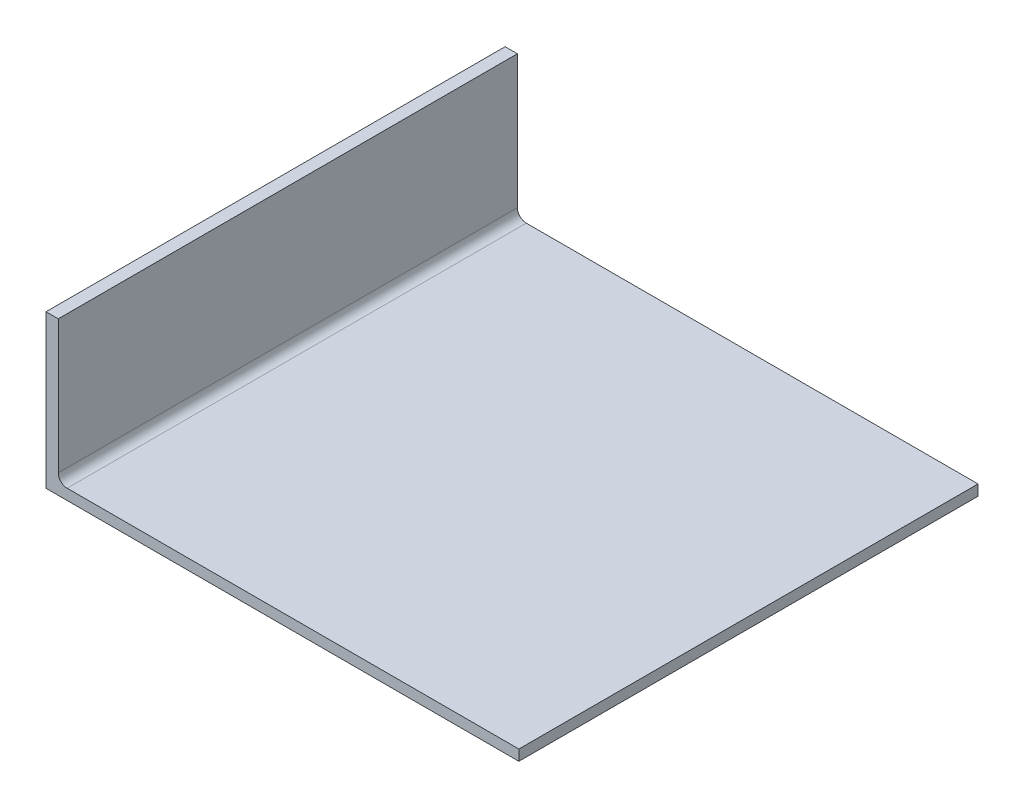
ISO-10303-21;
HEADER;
FILE_DESCRIPTION(('STEP AP214'),'2;1');
FILE_NAME('part.step','',(''),(''),'','','');
FILE_SCHEMA(('AUTOMOTIVE_DESIGN { 1 0 10303 214 1 1 1 1 }'));
ENDSEC;
DATA;
#1=APPLICATION_CONTEXT('core data for automotive mechanical design processes');
#2=APPLICATION_PROTOCOL_DEFINITION('international standard','automotive_design',2000,#1);
#3=PRODUCT_CONTEXT('',#1,'mechanical');
#4=PRODUCT('Part','Part','',(#3));
#5=PRODUCT_RELATED_PRODUCT_CATEGORY('part','',(#4));
#6=PRODUCT_DEFINITION_FORMATION('','',#4);
#7=PRODUCT_DEFINITION_CONTEXT('part definition',#1,'design');
#8=PRODUCT_DEFINITION('design','',#6,#7);
#9=PRODUCT_DEFINITION_SHAPE('','',#8);
#10=(LENGTH_UNIT() NAMED_UNIT(*) SI_UNIT(.MILLI.,.METRE.));
#11=(NAMED_UNIT(*) PLANE_ANGLE_UNIT() SI_UNIT($,.RADIAN.));
#12=(NAMED_UNIT(*) SI_UNIT($,.STERADIAN.) SOLID_ANGLE_UNIT());
#13=UNCERTAINTY_MEASURE_WITH_UNIT(LENGTH_MEASURE(1.E-05),#10,'distance_accuracy_value','');
#14=(GEOMETRIC_REPRESENTATION_CONTEXT(3) GLOBAL_UNCERTAINTY_ASSIGNED_CONTEXT((#13)) GLOBAL_UNIT_ASSIGNED_CONTEXT((#10,
#11,#12)) REPRESENTATION_CONTEXT('',''));
#15=CARTESIAN_POINT('',(0.,0.,0.));
#16=DIRECTION('',(0.,0.,1.));
#17=DIRECTION('',(1.,0.,0.));
#18=AXIS2_PLACEMENT_3D('',#15,#16,#17);
#19=CARTESIAN_POINT('',(-250.24028816854,11.,-21.2242669249853));
#20=DIRECTION('',(0.,0.,1.));
#21=DIRECTION('',(1.,0.,0.));
#22=AXIS2_PLACEMENT_3D('',#19,#20,#21);
#23=CYLINDRICAL_SURFACE('',#22,5.);
#24=DIRECTION('',(0.,0.,-1.));
#25=VECTOR('',#24,1.);
#26=CARTESIAN_POINT('',(-255.24028816854,11.,-21.2242669249853));
#27=LINE('',#26,#25);
#28=CARTESIAN_POINT('',(-255.24028816854,11.,236.996907771633));
#29=VERTEX_POINT('',#28);
#30=CARTESIAN_POINT('',(-255.24028816854,11.,-21.2242669249853));
#31=VERTEX_POINT('',#30);
#32=EDGE_CURVE('E143',#29,#31,#27,.T.);
#33=ORIENTED_EDGE('',*,*,#32,.F.);
#34=CARTESIAN_POINT('',(-250.24028816854,11.,236.996907771633));
#35=DIRECTION('',(0.,0.,-1.));
#36=DIRECTION('',(-1.,0.,0.));
#37=AXIS2_PLACEMENT_3D('',#34,#35,#36);
#38=CIRCLE('',#37,5.);
#39=CARTESIAN_POINT('',(-250.24028816854,6.,236.996907771633));
#40=VERTEX_POINT('',#39);
#41=EDGE_CURVE('E40',#29,#40,#38,.F.);
#42=ORIENTED_EDGE('',*,*,#41,.T.);
#43=DIRECTION('',(0.,0.,-1.));
#44=VECTOR('',#43,1.);
#45=CARTESIAN_POINT('',(-250.24028816854,6.,-21.2242669249853));
#46=LINE('',#45,#44);
#47=CARTESIAN_POINT('',(-250.24028816854,6.,-21.2242669249853));
#48=VERTEX_POINT('',#47);
#49=EDGE_CURVE('E146',#48,#40,#46,.F.);
#50=ORIENTED_EDGE('',*,*,#49,.F.);
#51=CARTESIAN_POINT('',(-250.24028816854,11.,-21.2242669249853));
#52=DIRECTION('',(0.,0.,1.));
#53=DIRECTION('',(1.,0.,0.));
#54=AXIS2_PLACEMENT_3D('',#51,#52,#53);
#55=CIRCLE('',#54,5.);
#56=EDGE_CURVE('E11',#48,#31,#55,.F.);
#57=ORIENTED_EDGE('',*,*,#56,.T.);
#58=EDGE_LOOP('',(#33,#42,#50,#57));
#59=FACE_BOUND('',#58,.T.);
#60=ADVANCED_FACE('F33',(#59),#23,.F.);
#61=CARTESIAN_POINT('',(0.,6.,0.));
#62=DIRECTION('',(0.,-1.,0.));
#63=DIRECTION('',(0.,0.,-1.));
#64=AXIS2_PLACEMENT_3D('',#61,#62,#63);
#65=PLANE('',#64);
#66=DIRECTION('',(-1.,0.,0.));
#67=VECTOR('',#66,1.);
#68=CARTESIAN_POINT('',(3.81792051641128,6.,-21.2242669249854));
#69=LINE('',#68,#67);
#70=CARTESIAN_POINT('',(3.81792051641128,6.,-21.2242669249854));
#71=VERTEX_POINT('',#70);
#72=EDGE_CURVE('E125',#71,#48,#69,.T.);
#73=ORIENTED_EDGE('',*,*,#72,.T.);
#74=ORIENTED_EDGE('',*,*,#49,.T.);
#75=DIRECTION('',(1.,0.,0.));
#76=VECTOR('',#75,1.);
#77=CARTESIAN_POINT('',(3.81792051641131,6.,236.996907771633));
#78=LINE('',#77,#76);
#79=CARTESIAN_POINT('',(3.81792051641131,6.,236.996907771633));
#80=VERTEX_POINT('',#79);
#81=EDGE_CURVE('E129',#40,#80,#78,.T.);
#82=ORIENTED_EDGE('',*,*,#81,.T.);
#83=DIRECTION('',(0.,0.,-1.));
#84=VECTOR('',#83,1.);
#85=CARTESIAN_POINT('',(3.81792051641128,6.,-21.2242669249854));
#86=LINE('',#85,#84);
#87=EDGE_CURVE('E122',#80,#71,#86,.T.);
#88=ORIENTED_EDGE('',*,*,#87,.T.);
#89=EDGE_LOOP('',(#73,#74,#82,#88));
#90=FACE_BOUND('',#89,.T.);
#91=ADVANCED_FACE('F149',(#90),#65,.F.);
#92=CARTESIAN_POINT('',(3.81792051641128,6.,-21.2242669249854));
#93=DIRECTION('',(-1.,0.,0.));
#94=DIRECTION('',(0.,0.,1.));
#95=AXIS2_PLACEMENT_3D('',#92,#93,#94);
#96=PLANE('',#95);
#97=DIRECTION('',(0.,0.,-1.));
#98=VECTOR('',#97,1.);
#99=CARTESIAN_POINT('',(3.81792051641128,0.,-21.2242669249854));
#100=LINE('',#99,#98);
#101=CARTESIAN_POINT('',(3.81792051641131,0.,236.996907771633));
#102=VERTEX_POINT('',#101);
#103=CARTESIAN_POINT('',(3.81792051641128,0.,-21.2242669249854));
#104=VERTEX_POINT('',#103);
#105=EDGE_CURVE('E121',#102,#104,#100,.T.);
#106=ORIENTED_EDGE('',*,*,#105,.T.);
#107=DIRECTION('',(0.,-1.,0.));
#108=VECTOR('',#107,1.);
#109=CARTESIAN_POINT('',(3.81792051641128,6.,-21.2242669249854));
#110=LINE('',#109,#108);
#111=EDGE_CURVE('E140',#71,#104,#110,.T.);
#112=ORIENTED_EDGE('',*,*,#111,.F.);
#113=ORIENTED_EDGE('',*,*,#87,.F.);
#114=DIRECTION('',(0.,-1.,0.));
#115=VECTOR('',#114,1.);
#116=CARTESIAN_POINT('',(3.81792051641131,6.,236.996907771633));
#117=LINE('',#116,#115);
#118=EDGE_CURVE('E99',#80,#102,#117,.T.);
#119=ORIENTED_EDGE('',*,*,#118,.T.);
#120=EDGE_LOOP('',(#106,#112,#113,#119));
#121=FACE_BOUND('',#120,.T.);
#122=ADVANCED_FACE('F155',(#121),#96,.F.);
#123=CARTESIAN_POINT('',(3.81792051641128,6.,-21.2242669249854));
#124=DIRECTION('',(0.,0.,1.));
#125=DIRECTION('',(1.,0.,0.));
#126=AXIS2_PLACEMENT_3D('',#123,#124,#125);
#127=PLANE('',#126);
#128=DIRECTION('',(-1.,0.,0.));
#129=VECTOR('',#128,1.);
#130=CARTESIAN_POINT('',(3.81792051641128,0.,-21.2242669249854));
#131=LINE('',#130,#129);
#132=CARTESIAN_POINT('',(-262.132502922839,0.,-21.2242669249853));
#133=VERTEX_POINT('',#132);
#134=EDGE_CURVE('E133',#104,#133,#131,.T.);
#135=ORIENTED_EDGE('',*,*,#134,.T.);
#136=DIRECTION('',(0.,-1.,0.));
#137=VECTOR('',#136,1.);
#138=CARTESIAN_POINT('',(-262.132502922839,6.,-21.2242669249853));
#139=LINE('',#138,#137);
#140=CARTESIAN_POINT('',(-262.132502922839,86.,-21.2242669249853));
#141=VERTEX_POINT('',#140);
#142=EDGE_CURVE('E98',#141,#133,#139,.T.);
#143=ORIENTED_EDGE('',*,*,#142,.F.);
#144=DIRECTION('',(-1.,0.,0.));
#145=VECTOR('',#144,1.);
#146=CARTESIAN_POINT('',(-262.132502922839,86.,-21.2242669249853));
#147=LINE('',#146,#145);
#148=CARTESIAN_POINT('',(-255.24028816854,86.,-21.2242669249853));
#149=VERTEX_POINT('',#148);
#150=EDGE_CURVE('E113',#149,#141,#147,.T.);
#151=ORIENTED_EDGE('',*,*,#150,.F.);
#152=DIRECTION('',(0.,-1.,0.));
#153=VECTOR('',#152,1.);
#154=CARTESIAN_POINT('',(-255.24028816854,86.,-21.2242669249853));
#155=LINE('',#154,#153);
#156=EDGE_CURVE('E118',#149,#31,#155,.T.);
#157=ORIENTED_EDGE('',*,*,#156,.T.);
#158=ORIENTED_EDGE('',*,*,#56,.F.);
#159=ORIENTED_EDGE('',*,*,#72,.F.);
#160=ORIENTED_EDGE('',*,*,#111,.T.);
#161=EDGE_LOOP('',(#135,#143,#151,#157,#158,#159,#160));
#162=FACE_BOUND('',#161,.T.);
#163=ADVANCED_FACE('F156',(#162),#127,.F.);
#164=CARTESIAN_POINT('',(-262.132502922839,6.,-21.2242669249853));
#165=DIRECTION('',(1.,0.,0.));
#166=DIRECTION('',(0.,0.,-1.));
#167=AXIS2_PLACEMENT_3D('',#164,#165,#166);
#168=PLANE('',#167);
#169=DIRECTION('',(0.,0.,1.));
#170=VECTOR('',#169,1.);
#171=CARTESIAN_POINT('',(-262.132502922839,0.,-21.2242669249853));
#172=LINE('',#171,#170);
#173=CARTESIAN_POINT('',(-262.132502922839,0.,236.996907771633));
#174=VERTEX_POINT('',#173);
#175=EDGE_CURVE('E95',#133,#174,#172,.T.);
#176=ORIENTED_EDGE('',*,*,#175,.T.);
#177=DIRECTION('',(0.,-1.,0.));
#178=VECTOR('',#177,1.);
#179=CARTESIAN_POINT('',(-262.132502922839,6.,236.996907771633));
#180=LINE('',#179,#178);
#181=CARTESIAN_POINT('',(-262.132502922839,86.,236.996907771633));
#182=VERTEX_POINT('',#181);
#183=EDGE_CURVE('E88',#182,#174,#180,.T.);
#184=ORIENTED_EDGE('',*,*,#183,.F.);
#185=DIRECTION('',(0.,0.,1.));
#186=VECTOR('',#185,1.);
#187=CARTESIAN_POINT('',(-262.132502922839,86.,-21.2242669249853));
#188=LINE('',#187,#186);
#189=EDGE_CURVE('E93',#141,#182,#188,.T.);
#190=ORIENTED_EDGE('',*,*,#189,.F.);
#191=ORIENTED_EDGE('',*,*,#142,.T.);
#192=EDGE_LOOP('',(#176,#184,#190,#191));
#193=FACE_BOUND('',#192,.T.);
#194=ADVANCED_FACE('F90',(#193),#168,.F.);
#195=CARTESIAN_POINT('',(3.81792051641131,6.,236.996907771633));
#196=DIRECTION('',(0.,0.,-1.));
#197=DIRECTION('',(-1.,0.,0.));
#198=AXIS2_PLACEMENT_3D('',#195,#196,#197);
#199=PLANE('',#198);
#200=DIRECTION('',(1.,0.,0.));
#201=VECTOR('',#200,1.);
#202=CARTESIAN_POINT('',(3.81792051641131,0.,236.996907771633));
#203=LINE('',#202,#201);
#204=EDGE_CURVE('E126',#174,#102,#203,.T.);
#205=ORIENTED_EDGE('',*,*,#204,.T.);
#206=ORIENTED_EDGE('',*,*,#118,.F.);
#207=ORIENTED_EDGE('',*,*,#81,.F.);
#208=ORIENTED_EDGE('',*,*,#41,.F.);
#209=DIRECTION('',(0.,-1.,0.));
#210=VECTOR('',#209,1.);
#211=CARTESIAN_POINT('',(-255.24028816854,86.,236.996907771633));
#212=LINE('',#211,#210);
#213=CARTESIAN_POINT('',(-255.24028816854,86.,236.996907771633));
#214=VERTEX_POINT('',#213);
#215=EDGE_CURVE('E105',#214,#29,#212,.T.);
#216=ORIENTED_EDGE('',*,*,#215,.F.);
#217=DIRECTION('',(1.,0.,0.));
#218=VECTOR('',#217,1.);
#219=CARTESIAN_POINT('',(-262.132502922839,86.,236.996907771633));
#220=LINE('',#219,#218);
#221=EDGE_CURVE('E102',#182,#214,#220,.T.);
#222=ORIENTED_EDGE('',*,*,#221,.F.);
#223=ORIENTED_EDGE('',*,*,#183,.T.);
#224=EDGE_LOOP('',(#205,#206,#207,#208,#216,#222,#223));
#225=FACE_BOUND('',#224,.T.);
#226=ADVANCED_FACE('F103',(#225),#199,.F.);
#227=CARTESIAN_POINT('',(0.,0.,0.));
#228=DIRECTION('',(0.,-1.,0.));
#229=DIRECTION('',(0.,0.,-1.));
#230=AXIS2_PLACEMENT_3D('',#227,#228,#229);
#231=PLANE('',#230);
#232=ORIENTED_EDGE('',*,*,#105,.F.);
#233=ORIENTED_EDGE('',*,*,#204,.F.);
#234=ORIENTED_EDGE('',*,*,#175,.F.);
#235=ORIENTED_EDGE('',*,*,#134,.F.);
#236=EDGE_LOOP('',(#232,#233,#234,#235));
#237=FACE_BOUND('',#236,.T.);
#238=ADVANCED_FACE('F158',(#237),#231,.T.);
#239=CARTESIAN_POINT('',(-255.24028816854,86.,-21.2242669249853));
#240=DIRECTION('',(-1.,0.,0.));
#241=DIRECTION('',(0.,0.,1.));
#242=AXIS2_PLACEMENT_3D('',#239,#240,#241);
#243=PLANE('',#242);
#244=ORIENTED_EDGE('',*,*,#215,.T.);
#245=ORIENTED_EDGE('',*,*,#32,.T.);
#246=ORIENTED_EDGE('',*,*,#156,.F.);
#247=DIRECTION('',(0.,0.,-1.));
#248=VECTOR('',#247,1.);
#249=CARTESIAN_POINT('',(-255.24028816854,86.,-21.2242669249853));
#250=LINE('',#249,#248);
#251=EDGE_CURVE('E108',#214,#149,#250,.T.);
#252=ORIENTED_EDGE('',*,*,#251,.F.);
#253=EDGE_LOOP('',(#244,#245,#246,#252));
#254=FACE_BOUND('',#253,.T.);
#255=ADVANCED_FACE('F160',(#254),#243,.F.);
#256=CARTESIAN_POINT('',(0.,86.,0.));
#257=DIRECTION('',(0.,1.,0.));
#258=DIRECTION('',(0.,0.,1.));
#259=AXIS2_PLACEMENT_3D('',#256,#257,#258);
#260=PLANE('',#259);
#261=ORIENTED_EDGE('',*,*,#189,.T.);
#262=ORIENTED_EDGE('',*,*,#221,.T.);
#263=ORIENTED_EDGE('',*,*,#251,.T.);
#264=ORIENTED_EDGE('',*,*,#150,.T.);
#265=EDGE_LOOP('',(#261,#262,#263,#264));
#266=FACE_BOUND('',#265,.T.);
#267=ADVANCED_FACE('F111',(#266),#260,.T.);
#268=CLOSED_SHELL('',(#60,#91,#122,#163,#194,#226,#238,#255,#267));
#269=MANIFOLD_SOLID_BREP('B2',#268);
#270=ADVANCED_BREP_SHAPE_REPRESENTATION('',(#18,#269),#14);
#271=SHAPE_DEFINITION_REPRESENTATION(#9,#270);
ENDSEC;
END-ISO-10303-21;
